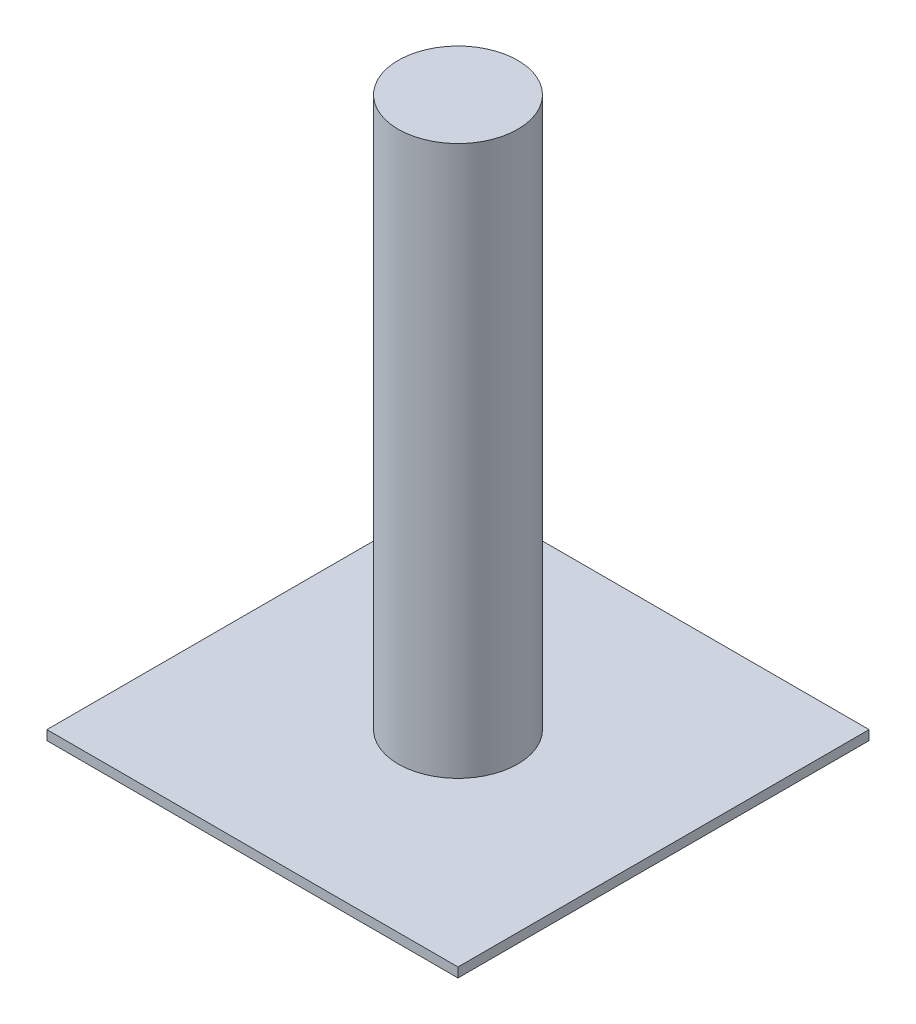
ISO-10303-21;
HEADER;
FILE_DESCRIPTION(('STEP AP214'),'2;1');
FILE_NAME('part.step','',(''),(''),'','','');
FILE_SCHEMA(('AUTOMOTIVE_DESIGN { 1 0 10303 214 1 1 1 1 }'));
ENDSEC;
DATA;
#1=APPLICATION_CONTEXT('core data for automotive mechanical design processes');
#2=APPLICATION_PROTOCOL_DEFINITION('international standard','automotive_design',2000,#1);
#3=PRODUCT_CONTEXT('',#1,'mechanical');
#4=PRODUCT('Part','Part','',(#3));
#5=PRODUCT_RELATED_PRODUCT_CATEGORY('part','',(#4));
#6=PRODUCT_DEFINITION_FORMATION('','',#4);
#7=PRODUCT_DEFINITION_CONTEXT('part definition',#1,'design');
#8=PRODUCT_DEFINITION('design','',#6,#7);
#9=PRODUCT_DEFINITION_SHAPE('','',#8);
#10=(LENGTH_UNIT() NAMED_UNIT(*) SI_UNIT(.MILLI.,.METRE.));
#11=(NAMED_UNIT(*) PLANE_ANGLE_UNIT() SI_UNIT($,.RADIAN.));
#12=(NAMED_UNIT(*) SI_UNIT($,.STERADIAN.) SOLID_ANGLE_UNIT());
#13=UNCERTAINTY_MEASURE_WITH_UNIT(LENGTH_MEASURE(1.E-05),#10,'distance_accuracy_value','');
#14=(GEOMETRIC_REPRESENTATION_CONTEXT(3) GLOBAL_UNCERTAINTY_ASSIGNED_CONTEXT((#13)) GLOBAL_UNIT_ASSIGNED_CONTEXT((#10,
#11,#12)) REPRESENTATION_CONTEXT('',''));
#15=CARTESIAN_POINT('',(0.,0.,0.));
#16=DIRECTION('',(0.,0.,1.));
#17=DIRECTION('',(1.,0.,0.));
#18=AXIS2_PLACEMENT_3D('',#15,#16,#17);
#19=CARTESIAN_POINT('',(43.,2.,-43.));
#20=DIRECTION('',(-1.,0.,0.));
#21=DIRECTION('',(0.,0.,1.));
#22=AXIS2_PLACEMENT_3D('',#19,#20,#21);
#23=PLANE('',#22);
#24=DIRECTION('',(0.,0.,-1.));
#25=VECTOR('',#24,1.);
#26=CARTESIAN_POINT('',(43.,0.,-43.));
#27=LINE('',#26,#25);
#28=CARTESIAN_POINT('',(43.,0.,43.));
#29=VERTEX_POINT('',#28);
#30=CARTESIAN_POINT('',(43.,0.,-43.));
#31=VERTEX_POINT('',#30);
#32=EDGE_CURVE('E110',#29,#31,#27,.T.);
#33=ORIENTED_EDGE('',*,*,#32,.T.);
#34=DIRECTION('',(0.,-1.,0.));
#35=VECTOR('',#34,1.);
#36=CARTESIAN_POINT('',(43.,2.,-43.));
#37=LINE('',#36,#35);
#38=CARTESIAN_POINT('',(43.,2.,-43.));
#39=VERTEX_POINT('',#38);
#40=EDGE_CURVE('E42',#39,#31,#37,.T.);
#41=ORIENTED_EDGE('',*,*,#40,.F.);
#42=DIRECTION('',(0.,0.,-1.));
#43=VECTOR('',#42,1.);
#44=CARTESIAN_POINT('',(43.,2.,-43.));
#45=LINE('',#44,#43);
#46=CARTESIAN_POINT('',(43.,2.,43.));
#47=VERTEX_POINT('',#46);
#48=EDGE_CURVE('E93',#47,#39,#45,.T.);
#49=ORIENTED_EDGE('',*,*,#48,.F.);
#50=DIRECTION('',(0.,-1.,0.));
#51=VECTOR('',#50,1.);
#52=CARTESIAN_POINT('',(43.,2.,43.));
#53=LINE('',#52,#51);
#54=EDGE_CURVE('E106',#47,#29,#53,.T.);
#55=ORIENTED_EDGE('',*,*,#54,.T.);
#56=EDGE_LOOP('',(#33,#41,#49,#55));
#57=FACE_BOUND('',#56,.T.);
#58=ADVANCED_FACE('F39',(#57),#23,.F.);
#59=CARTESIAN_POINT('',(-43.,2.,-43.));
#60=DIRECTION('',(0.,0.,1.));
#61=DIRECTION('',(1.,0.,0.));
#62=AXIS2_PLACEMENT_3D('',#59,#60,#61);
#63=PLANE('',#62);
#64=DIRECTION('',(-1.,0.,0.));
#65=VECTOR('',#64,1.);
#66=CARTESIAN_POINT('',(-43.,0.,-43.));
#67=LINE('',#66,#65);
#68=CARTESIAN_POINT('',(-43.,0.,-43.));
#69=VERTEX_POINT('',#68);
#70=EDGE_CURVE('E99',#31,#69,#67,.T.);
#71=ORIENTED_EDGE('',*,*,#70,.T.);
#72=DIRECTION('',(0.,-1.,0.));
#73=VECTOR('',#72,1.);
#74=CARTESIAN_POINT('',(-43.,2.,-43.));
#75=LINE('',#74,#73);
#76=CARTESIAN_POINT('',(-43.,2.,-43.));
#77=VERTEX_POINT('',#76);
#78=EDGE_CURVE('E97',#77,#69,#75,.T.);
#79=ORIENTED_EDGE('',*,*,#78,.F.);
#80=DIRECTION('',(-1.,0.,0.));
#81=VECTOR('',#80,1.);
#82=CARTESIAN_POINT('',(-43.,2.,-43.));
#83=LINE('',#82,#81);
#84=EDGE_CURVE('E88',#39,#77,#83,.T.);
#85=ORIENTED_EDGE('',*,*,#84,.F.);
#86=ORIENTED_EDGE('',*,*,#40,.T.);
#87=EDGE_LOOP('',(#71,#79,#85,#86));
#88=FACE_BOUND('',#87,.T.);
#89=ADVANCED_FACE('F98',(#88),#63,.F.);
#90=CARTESIAN_POINT('',(-43.,2.,-43.));
#91=DIRECTION('',(1.,0.,0.));
#92=DIRECTION('',(0.,0.,-1.));
#93=AXIS2_PLACEMENT_3D('',#90,#91,#92);
#94=PLANE('',#93);
#95=DIRECTION('',(0.,0.,1.));
#96=VECTOR('',#95,1.);
#97=CARTESIAN_POINT('',(-43.,0.,-43.));
#98=LINE('',#97,#96);
#99=CARTESIAN_POINT('',(-43.,0.,43.));
#100=VERTEX_POINT('',#99);
#101=EDGE_CURVE('E74',#69,#100,#98,.T.);
#102=ORIENTED_EDGE('',*,*,#101,.T.);
#103=DIRECTION('',(0.,-1.,0.));
#104=VECTOR('',#103,1.);
#105=CARTESIAN_POINT('',(-43.,2.,43.));
#106=LINE('',#105,#104);
#107=CARTESIAN_POINT('',(-43.,2.,43.));
#108=VERTEX_POINT('',#107);
#109=EDGE_CURVE('E101',#108,#100,#106,.T.);
#110=ORIENTED_EDGE('',*,*,#109,.F.);
#111=DIRECTION('',(0.,0.,1.));
#112=VECTOR('',#111,1.);
#113=CARTESIAN_POINT('',(-43.,2.,-43.));
#114=LINE('',#113,#112);
#115=EDGE_CURVE('E91',#77,#108,#114,.T.);
#116=ORIENTED_EDGE('',*,*,#115,.F.);
#117=ORIENTED_EDGE('',*,*,#78,.T.);
#118=EDGE_LOOP('',(#102,#110,#116,#117));
#119=FACE_BOUND('',#118,.T.);
#120=ADVANCED_FACE('F102',(#119),#94,.F.);
#121=CARTESIAN_POINT('',(-43.,2.,43.));
#122=DIRECTION('',(0.,0.,-1.));
#123=DIRECTION('',(-1.,0.,0.));
#124=AXIS2_PLACEMENT_3D('',#121,#122,#123);
#125=PLANE('',#124);
#126=DIRECTION('',(1.,0.,0.));
#127=VECTOR('',#126,1.);
#128=CARTESIAN_POINT('',(-43.,0.,43.));
#129=LINE('',#128,#127);
#130=EDGE_CURVE('E80',#100,#29,#129,.T.);
#131=ORIENTED_EDGE('',*,*,#130,.T.);
#132=ORIENTED_EDGE('',*,*,#54,.F.);
#133=DIRECTION('',(1.,0.,0.));
#134=VECTOR('',#133,1.);
#135=CARTESIAN_POINT('',(-43.,2.,43.));
#136=LINE('',#135,#134);
#137=EDGE_CURVE('E57',#108,#47,#136,.T.);
#138=ORIENTED_EDGE('',*,*,#137,.F.);
#139=ORIENTED_EDGE('',*,*,#109,.T.);
#140=EDGE_LOOP('',(#131,#132,#138,#139));
#141=FACE_BOUND('',#140,.T.);
#142=ADVANCED_FACE('F124',(#141),#125,.F.);
#143=CARTESIAN_POINT('',(0.,2.,0.));
#144=DIRECTION('',(0.,1.,0.));
#145=DIRECTION('',(0.,0.,1.));
#146=AXIS2_PLACEMENT_3D('',#143,#144,#145);
#147=PLANE('',#146);
#148=CARTESIAN_POINT('',(0.,2.,0.));
#149=DIRECTION('',(0.,1.,0.));
#150=DIRECTION('',(0.,0.,1.));
#151=AXIS2_PLACEMENT_3D('',#148,#149,#150);
#152=CIRCLE('',#151,12.5);
#153=CARTESIAN_POINT('',(0.,2.,12.5));
#154=VERTEX_POINT('',#153);
#155=EDGE_CURVE('E11',#154,#154,#152,.T.);
#156=ORIENTED_EDGE('',*,*,#155,.F.);
#157=EDGE_LOOP('',(#156));
#158=FACE_BOUND('',#157,.T.);
#159=ORIENTED_EDGE('',*,*,#48,.T.);
#160=ORIENTED_EDGE('',*,*,#84,.T.);
#161=ORIENTED_EDGE('',*,*,#115,.T.);
#162=ORIENTED_EDGE('',*,*,#137,.T.);
#163=EDGE_LOOP('',(#159,#160,#161,#162));
#164=FACE_BOUND('',#163,.T.);
#165=ADVANCED_FACE('F89',(#158,#164),#147,.T.);
#166=CARTESIAN_POINT('',(0.,0.,0.));
#167=DIRECTION('',(0.,1.,0.));
#168=DIRECTION('',(0.,0.,1.));
#169=AXIS2_PLACEMENT_3D('',#166,#167,#168);
#170=PLANE('',#169);
#171=ORIENTED_EDGE('',*,*,#32,.F.);
#172=ORIENTED_EDGE('',*,*,#130,.F.);
#173=ORIENTED_EDGE('',*,*,#101,.F.);
#174=ORIENTED_EDGE('',*,*,#70,.F.);
#175=EDGE_LOOP('',(#171,#172,#173,#174));
#176=FACE_BOUND('',#175,.T.);
#177=ADVANCED_FACE('F127',(#176),#170,.F.);
#178=CARTESIAN_POINT('',(0.,117.,0.));
#179=DIRECTION('',(0.,-1.,0.));
#180=DIRECTION('',(0.,0.,-1.));
#181=AXIS2_PLACEMENT_3D('',#178,#179,#180);
#182=CYLINDRICAL_SURFACE('',#181,12.5);
#183=CARTESIAN_POINT('',(0.,117.,0.));
#184=DIRECTION('',(0.,1.,0.));
#185=DIRECTION('',(0.,0.,1.));
#186=AXIS2_PLACEMENT_3D('',#183,#184,#185);
#187=CIRCLE('',#186,12.5);
#188=CARTESIAN_POINT('',(0.,117.,12.5));
#189=VERTEX_POINT('',#188);
#190=EDGE_CURVE('E114',#189,#189,#187,.T.);
#191=ORIENTED_EDGE('',*,*,#190,.F.);
#192=EDGE_LOOP('',(#191));
#193=FACE_BOUND('',#192,.T.);
#194=ORIENTED_EDGE('',*,*,#155,.T.);
#195=EDGE_LOOP('',(#194));
#196=FACE_BOUND('',#195,.T.);
#197=ADVANCED_FACE('F137',(#193,#196),#182,.T.);
#198=CARTESIAN_POINT('',(0.,117.,0.));
#199=DIRECTION('',(0.,1.,0.));
#200=DIRECTION('',(0.,0.,1.));
#201=AXIS2_PLACEMENT_3D('',#198,#199,#200);
#202=PLANE('',#201);
#203=ORIENTED_EDGE('',*,*,#190,.T.);
#204=EDGE_LOOP('',(#203));
#205=FACE_BOUND('',#204,.T.);
#206=ADVANCED_FACE('F135',(#205),#202,.T.);
#207=CLOSED_SHELL('',(#58,#89,#120,#142,#165,#177,#197,#206));
#208=MANIFOLD_SOLID_BREP('B2',#207);
#209=ADVANCED_BREP_SHAPE_REPRESENTATION('',(#18,#208),#14);
#210=SHAPE_DEFINITION_REPRESENTATION(#9,#209);
ENDSEC;
END-ISO-10303-21;
